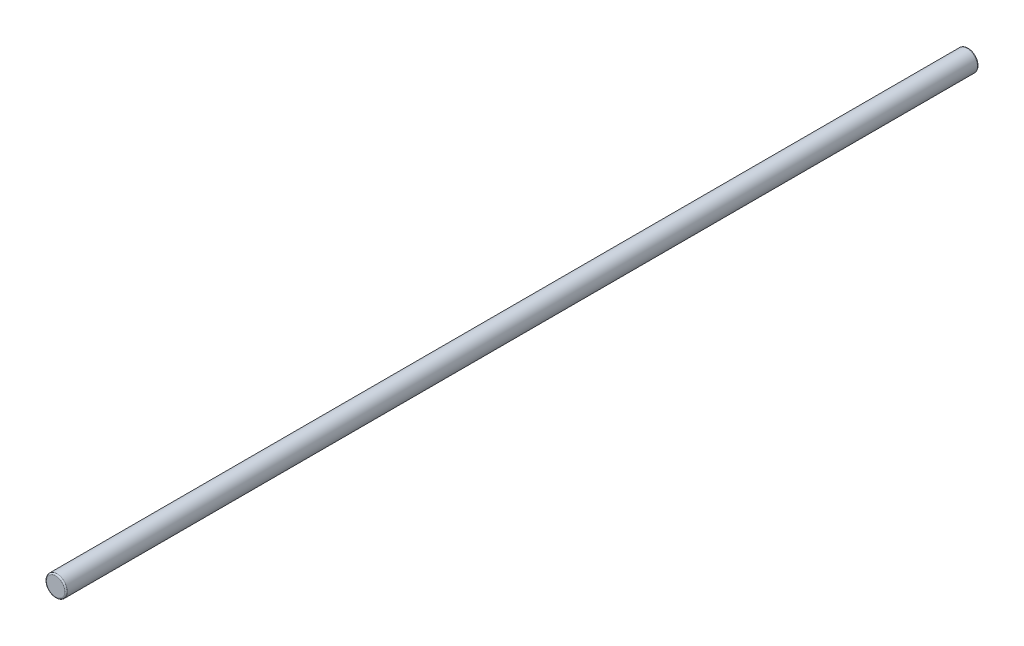
ISO-10303-21;
HEADER;
FILE_DESCRIPTION(('STEP AP214'),'2;1');
FILE_NAME('part.step','',(''),(''),'','','');
FILE_SCHEMA(('AUTOMOTIVE_DESIGN { 1 0 10303 214 1 1 1 1 }'));
ENDSEC;
DATA;
#1=APPLICATION_CONTEXT('core data for automotive mechanical design processes');
#2=APPLICATION_PROTOCOL_DEFINITION('international standard','automotive_design',2000,#1);
#3=PRODUCT_CONTEXT('',#1,'mechanical');
#4=PRODUCT('Part','Part','',(#3));
#5=PRODUCT_RELATED_PRODUCT_CATEGORY('part','',(#4));
#6=PRODUCT_DEFINITION_FORMATION('','',#4);
#7=PRODUCT_DEFINITION_CONTEXT('part definition',#1,'design');
#8=PRODUCT_DEFINITION('design','',#6,#7);
#9=PRODUCT_DEFINITION_SHAPE('','',#8);
#10=(LENGTH_UNIT() NAMED_UNIT(*) SI_UNIT(.MILLI.,.METRE.));
#11=(NAMED_UNIT(*) PLANE_ANGLE_UNIT() SI_UNIT($,.RADIAN.));
#12=(NAMED_UNIT(*) SI_UNIT($,.STERADIAN.) SOLID_ANGLE_UNIT());
#13=UNCERTAINTY_MEASURE_WITH_UNIT(LENGTH_MEASURE(1.E-05),#10,'distance_accuracy_value','');
#14=(GEOMETRIC_REPRESENTATION_CONTEXT(3) GLOBAL_UNCERTAINTY_ASSIGNED_CONTEXT((#13)) GLOBAL_UNIT_ASSIGNED_CONTEXT((#10,
#11,#12)) REPRESENTATION_CONTEXT('',''));
#15=CARTESIAN_POINT('',(0.,0.,0.));
#16=DIRECTION('',(0.,0.,1.));
#17=DIRECTION('',(1.,0.,0.));
#18=AXIS2_PLACEMENT_3D('',#15,#16,#17);
#19=CARTESIAN_POINT('',(0.,0.,350.));
#20=DIRECTION('',(0.,0.,-1.));
#21=DIRECTION('',(-1.,0.,0.));
#22=AXIS2_PLACEMENT_3D('',#19,#20,#21);
#23=CYLINDRICAL_SURFACE('',#22,4.);
#24=CARTESIAN_POINT('',(0.,0.,349.5));
#25=DIRECTION('',(0.,0.,1.));
#26=DIRECTION('',(1.,0.,0.));
#27=AXIS2_PLACEMENT_3D('',#24,#25,#26);
#28=CIRCLE('',#27,4.);
#29=CARTESIAN_POINT('',(4.,0.,349.5));
#30=VERTEX_POINT('',#29);
#31=EDGE_CURVE('E49',#30,#30,#28,.F.);
#32=ORIENTED_EDGE('',*,*,#31,.T.);
#33=EDGE_LOOP('',(#32));
#34=FACE_BOUND('',#33,.T.);
#35=CARTESIAN_POINT('',(0.,0.,0.5));
#36=DIRECTION('',(0.,0.,1.));
#37=DIRECTION('',(1.,0.,0.));
#38=AXIS2_PLACEMENT_3D('',#35,#36,#37);
#39=CIRCLE('',#38,4.);
#40=CARTESIAN_POINT('',(4.,0.,0.5));
#41=VERTEX_POINT('',#40);
#42=EDGE_CURVE('E54',#41,#41,#39,.T.);
#43=ORIENTED_EDGE('',*,*,#42,.T.);
#44=EDGE_LOOP('',(#43));
#45=FACE_BOUND('',#44,.T.);
#46=ADVANCED_FACE('F41',(#34,#45),#23,.T.);
#47=CARTESIAN_POINT('',(0.,0.,350.));
#48=DIRECTION('',(0.,0.,1.));
#49=DIRECTION('',(1.,0.,0.));
#50=AXIS2_PLACEMENT_3D('',#47,#48,#49);
#51=PLANE('',#50);
#52=CARTESIAN_POINT('',(0.,0.,350.));
#53=DIRECTION('',(0.,0.,1.));
#54=DIRECTION('',(1.,0.,0.));
#55=AXIS2_PLACEMENT_3D('',#52,#53,#54);
#56=CIRCLE('',#55,3.5);
#57=CARTESIAN_POINT('',(3.5,0.,350.));
#58=VERTEX_POINT('',#57);
#59=EDGE_CURVE('E59',#58,#58,#56,.T.);
#60=ORIENTED_EDGE('',*,*,#59,.T.);
#61=EDGE_LOOP('',(#60));
#62=FACE_BOUND('',#61,.T.);
#63=ADVANCED_FACE('F66',(#62),#51,.T.);
#64=CARTESIAN_POINT('',(0.,0.,0.));
#65=DIRECTION('',(0.,0.,1.));
#66=DIRECTION('',(1.,0.,0.));
#67=AXIS2_PLACEMENT_3D('',#64,#65,#66);
#68=PLANE('',#67);
#69=CARTESIAN_POINT('',(0.,0.,0.));
#70=DIRECTION('',(0.,0.,1.));
#71=DIRECTION('',(1.,0.,0.));
#72=AXIS2_PLACEMENT_3D('',#69,#70,#71);
#73=CIRCLE('',#72,3.5);
#74=CARTESIAN_POINT('',(3.5,0.,0.));
#75=VERTEX_POINT('',#74);
#76=EDGE_CURVE('E10',#75,#75,#73,.F.);
#77=ORIENTED_EDGE('',*,*,#76,.T.);
#78=EDGE_LOOP('',(#77));
#79=FACE_BOUND('',#78,.T.);
#80=ADVANCED_FACE('F70',(#79),#68,.F.);
#81=CARTESIAN_POINT('',(0.,0.,349.5));
#82=DIRECTION('',(0.,0.,1.));
#83=DIRECTION('',(1.,0.,0.));
#84=AXIS2_PLACEMENT_3D('',#81,#82,#83);
#85=TOROIDAL_SURFACE('',#84,3.5,0.5);
#86=ORIENTED_EDGE('',*,*,#31,.F.);
#87=EDGE_LOOP('',(#86));
#88=FACE_BOUND('',#87,.T.);
#89=ORIENTED_EDGE('',*,*,#59,.F.);
#90=EDGE_LOOP('',(#89));
#91=FACE_BOUND('',#90,.T.);
#92=ADVANCED_FACE('F68',(#88,#91),#85,.T.);
#93=CARTESIAN_POINT('',(0.,0.,0.5));
#94=DIRECTION('',(0.,0.,1.));
#95=DIRECTION('',(1.,0.,0.));
#96=AXIS2_PLACEMENT_3D('',#93,#94,#95);
#97=TOROIDAL_SURFACE('',#96,3.5,0.5);
#98=ORIENTED_EDGE('',*,*,#76,.F.);
#99=EDGE_LOOP('',(#98));
#100=FACE_BOUND('',#99,.T.);
#101=ORIENTED_EDGE('',*,*,#42,.F.);
#102=EDGE_LOOP('',(#101));
#103=FACE_BOUND('',#102,.T.);
#104=ADVANCED_FACE('F43',(#100,#103),#97,.T.);
#105=CLOSED_SHELL('',(#46,#63,#80,#92,#104));
#106=MANIFOLD_SOLID_BREP('B2',#105);
#107=ADVANCED_BREP_SHAPE_REPRESENTATION('',(#18,#106),#14);
#108=SHAPE_DEFINITION_REPRESENTATION(#9,#107);
ENDSEC;
END-ISO-10303-21;
